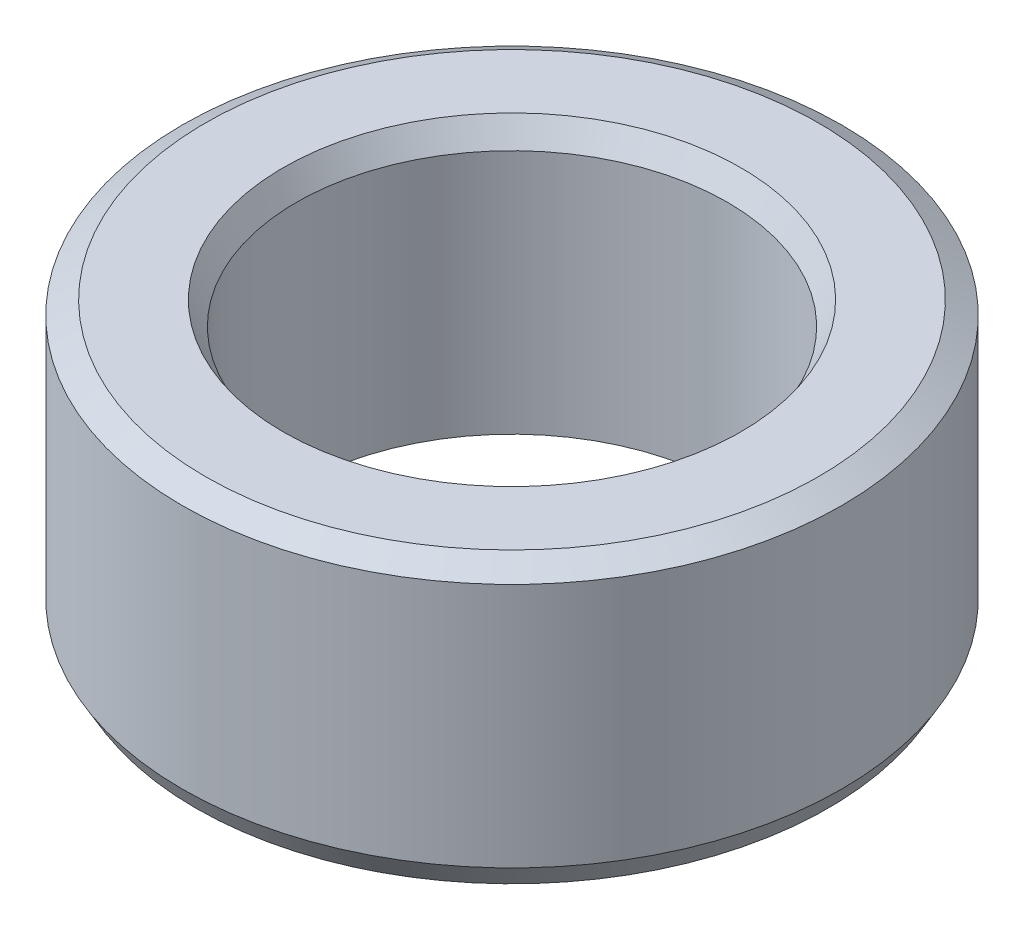
ISO-10303-21;
HEADER;
FILE_DESCRIPTION(('STEP AP214'),'2;1');
FILE_NAME('part.step','',(''),(''),'','','');
FILE_SCHEMA(('AUTOMOTIVE_DESIGN { 1 0 10303 214 1 1 1 1 }'));
ENDSEC;
DATA;
#1=APPLICATION_CONTEXT('core data for automotive mechanical design processes');
#2=APPLICATION_PROTOCOL_DEFINITION('international standard','automotive_design',2000,#1);
#3=PRODUCT_CONTEXT('',#1,'mechanical');
#4=PRODUCT('Part','Part','',(#3));
#5=PRODUCT_RELATED_PRODUCT_CATEGORY('part','',(#4));
#6=PRODUCT_DEFINITION_FORMATION('','',#4);
#7=PRODUCT_DEFINITION_CONTEXT('part definition',#1,'design');
#8=PRODUCT_DEFINITION('design','',#6,#7);
#9=PRODUCT_DEFINITION_SHAPE('','',#8);
#10=(LENGTH_UNIT() NAMED_UNIT(*) SI_UNIT(.MILLI.,.METRE.));
#11=(NAMED_UNIT(*) PLANE_ANGLE_UNIT() SI_UNIT($,.RADIAN.));
#12=(NAMED_UNIT(*) SI_UNIT($,.STERADIAN.) SOLID_ANGLE_UNIT());
#13=UNCERTAINTY_MEASURE_WITH_UNIT(LENGTH_MEASURE(1.E-05),#10,'distance_accuracy_value','');
#14=(GEOMETRIC_REPRESENTATION_CONTEXT(3) GLOBAL_UNCERTAINTY_ASSIGNED_CONTEXT((#13)) GLOBAL_UNIT_ASSIGNED_CONTEXT((#10,
#11,#12)) REPRESENTATION_CONTEXT('',''));
#15=CARTESIAN_POINT('',(0.,0.,0.));
#16=DIRECTION('',(0.,0.,1.));
#17=DIRECTION('',(1.,0.,0.));
#18=AXIS2_PLACEMENT_3D('',#15,#16,#17);
#19=CARTESIAN_POINT('',(0.,42.7884636988161,0.));
#20=DIRECTION('',(0.,-1.,0.));
#21=DIRECTION('',(0.,0.,-1.));
#22=AXIS2_PLACEMENT_3D('',#19,#20,#21);
#23=CYLINDRICAL_SURFACE('',#22,50.);
#24=CARTESIAN_POINT('',(0.,3.52270350265187,0.));
#25=DIRECTION('',(0.,1.,0.));
#26=DIRECTION('',(0.,0.,1.));
#27=AXIS2_PLACEMENT_3D('',#24,#25,#26);
#28=CIRCLE('',#27,50.);
#29=CARTESIAN_POINT('',(0.,3.52270350265187,50.));
#30=VERTEX_POINT('',#29);
#31=EDGE_CURVE('E10',#30,#30,#28,.T.);
#32=ORIENTED_EDGE('',*,*,#31,.T.);
#33=EDGE_LOOP('',(#32));
#34=FACE_BOUND('',#33,.T.);
#35=CARTESIAN_POINT('',(0.,40.7546298832848,0.));
#36=DIRECTION('',(0.,1.,0.));
#37=DIRECTION('',(0.,0.,1.));
#38=AXIS2_PLACEMENT_3D('',#35,#36,#37);
#39=CIRCLE('',#38,50.);
#40=CARTESIAN_POINT('',(0.,40.7546298832848,50.));
#41=VERTEX_POINT('',#40);
#42=EDGE_CURVE('E50',#41,#41,#39,.F.);
#43=ORIENTED_EDGE('',*,*,#42,.T.);
#44=EDGE_LOOP('',(#43));
#45=FACE_BOUND('',#44,.T.);
#46=ADVANCED_FACE('F39',(#34,#45),#23,.T.);
#47=CARTESIAN_POINT('',(0.,42.7884636988161,0.));
#48=DIRECTION('',(0.,1.,0.));
#49=DIRECTION('',(0.,0.,1.));
#50=AXIS2_PLACEMENT_3D('',#47,#48,#49);
#51=PLANE('',#50);
#52=CARTESIAN_POINT('',(0.,42.7884636988161,0.));
#53=DIRECTION('',(0.,1.,0.));
#54=DIRECTION('',(0.,0.,1.));
#55=AXIS2_PLACEMENT_3D('',#52,#53,#54);
#56=CIRCLE('',#55,34.7066712333655);
#57=CARTESIAN_POINT('',(0.,42.7884636988161,34.7066712333655));
#58=VERTEX_POINT('',#57);
#59=EDGE_CURVE('E58',#58,#58,#56,.F.);
#60=ORIENTED_EDGE('',*,*,#59,.T.);
#61=EDGE_LOOP('',(#60));
#62=FACE_BOUND('',#61,.T.);
#63=CARTESIAN_POINT('',(0.,42.7884636988161,0.));
#64=DIRECTION('',(0.,1.,0.));
#65=DIRECTION('',(0.,0.,1.));
#66=AXIS2_PLACEMENT_3D('',#63,#64,#65);
#67=CIRCLE('',#66,46.4772964973482);
#68=CARTESIAN_POINT('',(0.,42.7884636988161,46.4772964973482));
#69=VERTEX_POINT('',#68);
#70=EDGE_CURVE('E61',#69,#69,#67,.T.);
#71=ORIENTED_EDGE('',*,*,#70,.T.);
#72=EDGE_LOOP('',(#71));
#73=FACE_BOUND('',#72,.T.);
#74=ADVANCED_FACE('F88',(#62,#73),#51,.T.);
#75=CARTESIAN_POINT('',(0.,0.,0.));
#76=DIRECTION('',(0.,1.,0.));
#77=DIRECTION('',(0.,0.,1.));
#78=AXIS2_PLACEMENT_3D('',#75,#76,#77);
#79=PLANE('',#78);
#80=CARTESIAN_POINT('',(0.,0.,0.));
#81=DIRECTION('',(0.,1.,0.));
#82=DIRECTION('',(0.,0.,1.));
#83=AXIS2_PLACEMENT_3D('',#80,#81,#82);
#84=CIRCLE('',#83,36.195540920486);
#85=CARTESIAN_POINT('',(0.,0.,36.195540920486));
#86=VERTEX_POINT('',#85);
#87=EDGE_CURVE('E51',#86,#86,#84,.T.);
#88=ORIENTED_EDGE('',*,*,#87,.T.);
#89=EDGE_LOOP('',(#88));
#90=FACE_BOUND('',#89,.T.);
#91=CARTESIAN_POINT('',(0.,0.,0.));
#92=DIRECTION('',(0.,1.,0.));
#93=DIRECTION('',(0.,0.,1.));
#94=AXIS2_PLACEMENT_3D('',#91,#92,#93);
#95=CIRCLE('',#94,47.9661661844687);
#96=CARTESIAN_POINT('',(0.,0.,47.9661661844687));
#97=VERTEX_POINT('',#96);
#98=EDGE_CURVE('E54',#97,#97,#95,.F.);
#99=ORIENTED_EDGE('',*,*,#98,.T.);
#100=EDGE_LOOP('',(#99));
#101=FACE_BOUND('',#100,.T.);
#102=ADVANCED_FACE('F83',(#90,#101),#79,.F.);
#103=CARTESIAN_POINT('',(0.,42.7884636988161,0.));
#104=DIRECTION('',(0.,-1.,0.));
#105=DIRECTION('',(0.,0.,-1.));
#106=AXIS2_PLACEMENT_3D('',#103,#104,#105);
#107=CYLINDRICAL_SURFACE('',#106,32.6728374178342);
#108=CARTESIAN_POINT('',(0.,39.2657601961642,0.));
#109=DIRECTION('',(0.,1.,0.));
#110=DIRECTION('',(0.,0.,1.));
#111=AXIS2_PLACEMENT_3D('',#108,#109,#110);
#112=CIRCLE('',#111,32.6728374178342);
#113=CARTESIAN_POINT('',(0.,39.2657601961642,32.6728374178342));
#114=VERTEX_POINT('',#113);
#115=EDGE_CURVE('E67',#114,#114,#112,.T.);
#116=ORIENTED_EDGE('',*,*,#115,.T.);
#117=EDGE_LOOP('',(#116));
#118=FACE_BOUND('',#117,.T.);
#119=CARTESIAN_POINT('',(0.,2.03383381553127,0.));
#120=DIRECTION('',(0.,1.,0.));
#121=DIRECTION('',(0.,0.,1.));
#122=AXIS2_PLACEMENT_3D('',#119,#120,#121);
#123=CIRCLE('',#122,32.6728374178342);
#124=CARTESIAN_POINT('',(0.,2.03383381553127,32.6728374178342));
#125=VERTEX_POINT('',#124);
#126=EDGE_CURVE('E69',#125,#125,#123,.F.);
#127=ORIENTED_EDGE('',*,*,#126,.T.);
#128=EDGE_LOOP('',(#127));
#129=FACE_BOUND('',#128,.T.);
#130=ADVANCED_FACE('F71',(#118,#129),#107,.F.);
#131=CARTESIAN_POINT('',(0.,39.2657601961642,0.));
#132=DIRECTION('',(0.,1.,0.));
#133=DIRECTION('',(0.,0.,1.));
#134=AXIS2_PLACEMENT_3D('',#131,#132,#133);
#135=CONICAL_SURFACE('',#134,32.6728374178342,0.523598775598305);
#136=ORIENTED_EDGE('',*,*,#59,.F.);
#137=EDGE_LOOP('',(#136));
#138=FACE_BOUND('',#137,.T.);
#139=ORIENTED_EDGE('',*,*,#115,.F.);
#140=EDGE_LOOP('',(#139));
#141=FACE_BOUND('',#140,.T.);
#142=ADVANCED_FACE('F77',(#138,#141),#135,.F.);
#143=CARTESIAN_POINT('',(0.,0.,0.));
#144=DIRECTION('',(0.,-1.,0.));
#145=DIRECTION('',(0.,0.,-1.));
#146=AXIS2_PLACEMENT_3D('',#143,#144,#145);
#147=CONICAL_SURFACE('',#146,36.195540920486,1.04719755119659);
#148=ORIENTED_EDGE('',*,*,#126,.F.);
#149=EDGE_LOOP('',(#148));
#150=FACE_BOUND('',#149,.T.);
#151=ORIENTED_EDGE('',*,*,#87,.F.);
#152=EDGE_LOOP('',(#151));
#153=FACE_BOUND('',#152,.T.);
#154=ADVANCED_FACE('F73',(#150,#153),#147,.F.);
#155=CARTESIAN_POINT('',(0.,3.52270350265187,0.));
#156=DIRECTION('',(0.,1.,0.));
#157=DIRECTION('',(0.,0.,1.));
#158=AXIS2_PLACEMENT_3D('',#155,#156,#157);
#159=CONICAL_SURFACE('',#158,50.,0.523598775598302);
#160=ORIENTED_EDGE('',*,*,#98,.F.);
#161=EDGE_LOOP('',(#160));
#162=FACE_BOUND('',#161,.T.);
#163=ORIENTED_EDGE('',*,*,#31,.F.);
#164=EDGE_LOOP('',(#163));
#165=FACE_BOUND('',#164,.T.);
#166=ADVANCED_FACE('F76',(#162,#165),#159,.T.);
#167=CARTESIAN_POINT('',(0.,42.7884636988161,0.));
#168=DIRECTION('',(0.,-1.,0.));
#169=DIRECTION('',(0.,0.,-1.));
#170=AXIS2_PLACEMENT_3D('',#167,#168,#169);
#171=CONICAL_SURFACE('',#170,46.4772964973482,1.04719755119659);
#172=ORIENTED_EDGE('',*,*,#42,.F.);
#173=EDGE_LOOP('',(#172));
#174=FACE_BOUND('',#173,.T.);
#175=ORIENTED_EDGE('',*,*,#70,.F.);
#176=EDGE_LOOP('',(#175));
#177=FACE_BOUND('',#176,.T.);
#178=ADVANCED_FACE('F45',(#174,#177),#171,.T.);
#179=CLOSED_SHELL('',(#46,#74,#102,#130,#142,#154,#166,#178));
#180=MANIFOLD_SOLID_BREP('B2',#179);
#181=ADVANCED_BREP_SHAPE_REPRESENTATION('',(#18,#180),#14);
#182=SHAPE_DEFINITION_REPRESENTATION(#9,#181);
ENDSEC;
END-ISO-10303-21;
